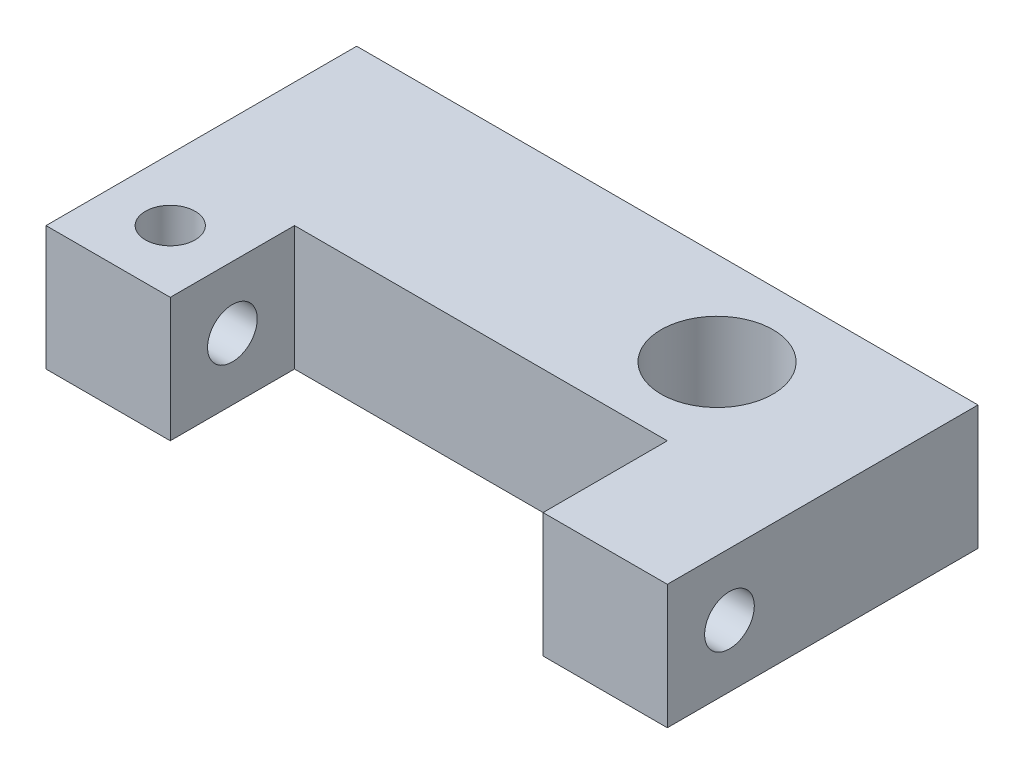
ISO-10303-21;
HEADER;
FILE_DESCRIPTION(('STEP AP214'),'2;1');
FILE_NAME('part.step','',(''),(''),'','','');
FILE_SCHEMA(('AUTOMOTIVE_DESIGN { 1 0 10303 214 1 1 1 1 }'));
ENDSEC;
DATA;
#1=APPLICATION_CONTEXT('core data for automotive mechanical design processes');
#2=APPLICATION_PROTOCOL_DEFINITION('international standard','automotive_design',2000,#1);
#3=PRODUCT_CONTEXT('',#1,'mechanical');
#4=PRODUCT('Part','Part','',(#3));
#5=PRODUCT_RELATED_PRODUCT_CATEGORY('part','',(#4));
#6=PRODUCT_DEFINITION_FORMATION('','',#4);
#7=PRODUCT_DEFINITION_CONTEXT('part definition',#1,'design');
#8=PRODUCT_DEFINITION('design','',#6,#7);
#9=PRODUCT_DEFINITION_SHAPE('','',#8);
#10=(LENGTH_UNIT() NAMED_UNIT(*) SI_UNIT(.MILLI.,.METRE.));
#11=(NAMED_UNIT(*) PLANE_ANGLE_UNIT() SI_UNIT($,.RADIAN.));
#12=(NAMED_UNIT(*) SI_UNIT($,.STERADIAN.) SOLID_ANGLE_UNIT());
#13=UNCERTAINTY_MEASURE_WITH_UNIT(LENGTH_MEASURE(1.E-05),#10,'distance_accuracy_value','');
#14=(GEOMETRIC_REPRESENTATION_CONTEXT(3) GLOBAL_UNCERTAINTY_ASSIGNED_CONTEXT((#13)) GLOBAL_UNIT_ASSIGNED_CONTEXT((#10,
#11,#12)) REPRESENTATION_CONTEXT('',''));
#15=CARTESIAN_POINT('',(0.,0.,0.));
#16=DIRECTION('',(0.,0.,1.));
#17=DIRECTION('',(1.,0.,0.));
#18=AXIS2_PLACEMENT_3D('',#15,#16,#17);
#19=CARTESIAN_POINT('',(0.,0.,0.));
#20=DIRECTION('',(0.,0.,-1.));
#21=DIRECTION('',(-1.,0.,0.));
#22=AXIS2_PLACEMENT_3D('',#19,#20,#21);
#23=PLANE('',#22);
#24=DIRECTION('',(0.,-1.,0.));
#25=VECTOR('',#24,1.);
#26=CARTESIAN_POINT('',(6.00000000000001,4.,0.));
#27=LINE('',#26,#25);
#28=CARTESIAN_POINT('',(6.00000000000001,4.,0.));
#29=VERTEX_POINT('',#28);
#30=CARTESIAN_POINT('',(6.,0.,0.));
#31=VERTEX_POINT('',#30);
#32=EDGE_CURVE('E252',#29,#31,#27,.T.);
#33=ORIENTED_EDGE('',*,*,#32,.F.);
#34=DIRECTION('',(-1.,0.,0.));
#35=VECTOR('',#34,1.);
#36=CARTESIAN_POINT('',(-10.,4.,0.));
#37=LINE('',#36,#35);
#38=CARTESIAN_POINT('',(-6.00000000000001,4.,0.));
#39=VERTEX_POINT('',#38);
#40=EDGE_CURVE('E205',#29,#39,#37,.T.);
#41=ORIENTED_EDGE('',*,*,#40,.T.);
#42=DIRECTION('',(0.,1.,0.));
#43=VECTOR('',#42,1.);
#44=CARTESIAN_POINT('',(-6.00000000000001,4.,0.));
#45=LINE('',#44,#43);
#46=CARTESIAN_POINT('',(-6.00000000000001,0.,0.));
#47=VERTEX_POINT('',#46);
#48=EDGE_CURVE('E247',#47,#39,#45,.T.);
#49=ORIENTED_EDGE('',*,*,#48,.F.);
#50=DIRECTION('',(1.,0.,0.));
#51=VECTOR('',#50,1.);
#52=CARTESIAN_POINT('',(-10.,0.,0.));
#53=LINE('',#52,#51);
#54=CARTESIAN_POINT('',(2.19999999999999,0.,0.));
#55=VERTEX_POINT('',#54);
#56=EDGE_CURVE('E202',#47,#55,#53,.T.);
#57=ORIENTED_EDGE('',*,*,#56,.T.);
#58=DIRECTION('',(0.,-1.,0.));
#59=VECTOR('',#58,1.);
#60=CARTESIAN_POINT('',(2.19999999999999,0.,0.));
#61=LINE('',#60,#59);
#62=CARTESIAN_POINT('',(2.19999999999999,-2.,0.));
#63=VERTEX_POINT('',#62);
#64=EDGE_CURVE('E198',#55,#63,#61,.T.);
#65=ORIENTED_EDGE('',*,*,#64,.T.);
#66=DIRECTION('',(1.,0.,0.));
#67=VECTOR('',#66,1.);
#68=CARTESIAN_POINT('',(2.19999999999999,-2.,0.));
#69=LINE('',#68,#67);
#70=CARTESIAN_POINT('',(6.99999999999999,-2.,0.));
#71=VERTEX_POINT('',#70);
#72=EDGE_CURVE('E194',#63,#71,#69,.T.);
#73=ORIENTED_EDGE('',*,*,#72,.T.);
#74=DIRECTION('',(0.,1.,0.));
#75=VECTOR('',#74,1.);
#76=CARTESIAN_POINT('',(6.99999999999999,0.,0.));
#77=LINE('',#76,#75);
#78=CARTESIAN_POINT('',(6.99999999999999,0.,0.));
#79=VERTEX_POINT('',#78);
#80=EDGE_CURVE('E190',#71,#79,#77,.T.);
#81=ORIENTED_EDGE('',*,*,#80,.T.);
#82=DIRECTION('',(1.,0.,0.));
#83=VECTOR('',#82,1.);
#84=CARTESIAN_POINT('',(10.,0.,0.));
#85=LINE('',#84,#83);
#86=EDGE_CURVE('E64',#31,#79,#85,.T.);
#87=ORIENTED_EDGE('',*,*,#86,.F.);
#88=EDGE_LOOP('',(#33,#41,#49,#57,#65,#73,#81,#87));
#89=FACE_BOUND('',#88,.T.);
#90=ADVANCED_FACE('F43',(#89),#23,.F.);
#91=CARTESIAN_POINT('',(6.99999999999999,0.,-6.));
#92=DIRECTION('',(0.,-1.,0.));
#93=DIRECTION('',(1.,0.,0.));
#94=AXIS2_PLACEMENT_3D('',#91,#92,#93);
#95=PLANE('',#94);
#96=DIRECTION('',(0.,0.,1.));
#97=VECTOR('',#96,1.);
#98=CARTESIAN_POINT('',(9.99999999999999,0.,-6.));
#99=LINE('',#98,#97);
#100=CARTESIAN_POINT('',(9.99999999999999,0.,-6.));
#101=VERTEX_POINT('',#100);
#102=CARTESIAN_POINT('',(10.,0.,4.));
#103=VERTEX_POINT('',#102);
#104=EDGE_CURVE('E165',#101,#103,#99,.T.);
#105=ORIENTED_EDGE('',*,*,#104,.T.);
#106=DIRECTION('',(1.,0.,0.));
#107=VECTOR('',#106,1.);
#108=CARTESIAN_POINT('',(10.,0.,4.));
#109=LINE('',#108,#107);
#110=CARTESIAN_POINT('',(6.,0.,4.));
#111=VERTEX_POINT('',#110);
#112=EDGE_CURVE('E275',#111,#103,#109,.T.);
#113=ORIENTED_EDGE('',*,*,#112,.F.);
#114=DIRECTION('',(0.,0.,-1.));
#115=VECTOR('',#114,1.);
#116=CARTESIAN_POINT('',(6.,0.,4.));
#117=LINE('',#116,#115);
#118=EDGE_CURVE('E279',#111,#31,#117,.T.);
#119=ORIENTED_EDGE('',*,*,#118,.T.);
#120=ORIENTED_EDGE('',*,*,#86,.T.);
#121=DIRECTION('',(0.,0.,1.));
#122=VECTOR('',#121,1.);
#123=CARTESIAN_POINT('',(6.99999999999999,0.,-6.));
#124=LINE('',#123,#122);
#125=CARTESIAN_POINT('',(6.99999999999999,0.,-6.));
#126=VERTEX_POINT('',#125);
#127=EDGE_CURVE('E139',#126,#79,#124,.T.);
#128=ORIENTED_EDGE('',*,*,#127,.F.);
#129=DIRECTION('',(1.,0.,0.));
#130=VECTOR('',#129,1.);
#131=CARTESIAN_POINT('',(6.99999999999999,0.,-6.));
#132=LINE('',#131,#130);
#133=EDGE_CURVE('E193',#126,#101,#132,.T.);
#134=ORIENTED_EDGE('',*,*,#133,.T.);
#135=EDGE_LOOP('',(#105,#113,#119,#120,#128,#134));
#136=FACE_BOUND('',#135,.T.);
#137=ADVANCED_FACE('F45',(#136),#95,.T.);
#138=CARTESIAN_POINT('',(6.99999999999999,0.,-6.));
#139=DIRECTION('',(1.,0.,0.));
#140=DIRECTION('',(0.,0.,-1.));
#141=AXIS2_PLACEMENT_3D('',#138,#139,#140);
#142=PLANE('',#141);
#143=ORIENTED_EDGE('',*,*,#80,.F.);
#144=DIRECTION('',(0.,0.,1.));
#145=VECTOR('',#144,1.);
#146=CARTESIAN_POINT('',(6.99999999999999,-2.,-6.));
#147=LINE('',#146,#145);
#148=CARTESIAN_POINT('',(6.99999999999999,-2.,-6.));
#149=VERTEX_POINT('',#148);
#150=EDGE_CURVE('E185',#149,#71,#147,.T.);
#151=ORIENTED_EDGE('',*,*,#150,.F.);
#152=DIRECTION('',(0.,1.,0.));
#153=VECTOR('',#152,1.);
#154=CARTESIAN_POINT('',(6.99999999999999,0.,-6.));
#155=LINE('',#154,#153);
#156=EDGE_CURVE('E169',#149,#126,#155,.T.);
#157=ORIENTED_EDGE('',*,*,#156,.T.);
#158=ORIENTED_EDGE('',*,*,#127,.T.);
#159=EDGE_LOOP('',(#143,#151,#157,#158));
#160=FACE_BOUND('',#159,.T.);
#161=ADVANCED_FACE('F341',(#160),#142,.T.);
#162=CARTESIAN_POINT('',(2.19999999999999,-2.,-6.));
#163=DIRECTION('',(0.,-1.,0.));
#164=DIRECTION('',(0.,0.,-1.));
#165=AXIS2_PLACEMENT_3D('',#162,#163,#164);
#166=PLANE('',#165);
#167=CARTESIAN_POINT('',(4.59999999999999,-2.,-3.));
#168=DIRECTION('',(0.,1.,0.));
#169=DIRECTION('',(0.,0.,1.));
#170=AXIS2_PLACEMENT_3D('',#167,#168,#169);
#171=CIRCLE('',#170,1.8);
#172=CARTESIAN_POINT('',(4.59999999999999,-2.,-1.2));
#173=VERTEX_POINT('',#172);
#174=EDGE_CURVE('E297',#173,#173,#171,.T.);
#175=ORIENTED_EDGE('',*,*,#174,.T.);
#176=EDGE_LOOP('',(#175));
#177=FACE_BOUND('',#176,.T.);
#178=ORIENTED_EDGE('',*,*,#72,.F.);
#179=DIRECTION('',(0.,0.,1.));
#180=VECTOR('',#179,1.);
#181=CARTESIAN_POINT('',(2.19999999999999,-2.,-6.));
#182=LINE('',#181,#180);
#183=CARTESIAN_POINT('',(2.19999999999999,-2.,-6.));
#184=VERTEX_POINT('',#183);
#185=EDGE_CURVE('E182',#184,#63,#182,.T.);
#186=ORIENTED_EDGE('',*,*,#185,.F.);
#187=DIRECTION('',(1.,0.,0.));
#188=VECTOR('',#187,1.);
#189=CARTESIAN_POINT('',(2.19999999999999,-2.,-6.));
#190=LINE('',#189,#188);
#191=EDGE_CURVE('E212',#184,#149,#190,.T.);
#192=ORIENTED_EDGE('',*,*,#191,.T.);
#193=ORIENTED_EDGE('',*,*,#150,.T.);
#194=EDGE_LOOP('',(#178,#186,#192,#193));
#195=FACE_BOUND('',#194,.T.);
#196=ADVANCED_FACE('F344',(#177,#195),#166,.T.);
#197=CARTESIAN_POINT('',(2.19999999999999,0.,-6.));
#198=DIRECTION('',(-1.,0.,0.));
#199=DIRECTION('',(0.,-1.,0.));
#200=AXIS2_PLACEMENT_3D('',#197,#198,#199);
#201=PLANE('',#200);
#202=ORIENTED_EDGE('',*,*,#64,.F.);
#203=DIRECTION('',(0.,0.,1.));
#204=VECTOR('',#203,1.);
#205=CARTESIAN_POINT('',(2.19999999999999,0.,-6.));
#206=LINE('',#205,#204);
#207=CARTESIAN_POINT('',(2.19999999999999,0.,-6.));
#208=VERTEX_POINT('',#207);
#209=EDGE_CURVE('E178',#208,#55,#206,.T.);
#210=ORIENTED_EDGE('',*,*,#209,.F.);
#211=DIRECTION('',(0.,-1.,0.));
#212=VECTOR('',#211,1.);
#213=CARTESIAN_POINT('',(2.19999999999999,0.,-6.));
#214=LINE('',#213,#212);
#215=EDGE_CURVE('E216',#208,#184,#214,.T.);
#216=ORIENTED_EDGE('',*,*,#215,.T.);
#217=ORIENTED_EDGE('',*,*,#185,.T.);
#218=EDGE_LOOP('',(#202,#210,#216,#217));
#219=FACE_BOUND('',#218,.T.);
#220=ADVANCED_FACE('F348',(#219),#201,.T.);
#221=CARTESIAN_POINT('',(-10.,0.,-6.));
#222=DIRECTION('',(0.,-1.,0.));
#223=DIRECTION('',(1.,0.,0.));
#224=AXIS2_PLACEMENT_3D('',#221,#222,#223);
#225=PLANE('',#224);
#226=ORIENTED_EDGE('',*,*,#56,.F.);
#227=DIRECTION('',(0.,0.,-1.));
#228=VECTOR('',#227,1.);
#229=CARTESIAN_POINT('',(-6.,0.,4.));
#230=LINE('',#229,#228);
#231=CARTESIAN_POINT('',(-6.,0.,4.));
#232=VERTEX_POINT('',#231);
#233=EDGE_CURVE('E208',#232,#47,#230,.T.);
#234=ORIENTED_EDGE('',*,*,#233,.F.);
#235=DIRECTION('',(1.,0.,0.));
#236=VECTOR('',#235,1.);
#237=CARTESIAN_POINT('',(-10.,0.,4.));
#238=LINE('',#237,#236);
#239=CARTESIAN_POINT('',(-10.,0.,4.));
#240=VERTEX_POINT('',#239);
#241=EDGE_CURVE('E259',#240,#232,#238,.T.);
#242=ORIENTED_EDGE('',*,*,#241,.F.);
#243=DIRECTION('',(0.,0.,1.));
#244=VECTOR('',#243,1.);
#245=CARTESIAN_POINT('',(-10.,0.,-6.));
#246=LINE('',#245,#244);
#247=CARTESIAN_POINT('',(-10.,0.,-6.));
#248=VERTEX_POINT('',#247);
#249=EDGE_CURVE('E175',#248,#240,#246,.T.);
#250=ORIENTED_EDGE('',*,*,#249,.F.);
#251=DIRECTION('',(1.,0.,0.));
#252=VECTOR('',#251,1.);
#253=CARTESIAN_POINT('',(-10.,0.,-6.));
#254=LINE('',#253,#252);
#255=EDGE_CURVE('E220',#248,#208,#254,.T.);
#256=ORIENTED_EDGE('',*,*,#255,.T.);
#257=ORIENTED_EDGE('',*,*,#209,.T.);
#258=EDGE_LOOP('',(#226,#234,#242,#250,#256,#257));
#259=FACE_BOUND('',#258,.T.);
#260=ADVANCED_FACE('F351',(#259),#225,.T.);
#261=CARTESIAN_POINT('',(-10.,4.,-6.));
#262=DIRECTION('',(-1.,0.,0.));
#263=DIRECTION('',(0.,0.,1.));
#264=AXIS2_PLACEMENT_3D('',#261,#262,#263);
#265=PLANE('',#264);
#266=CARTESIAN_POINT('',(-10.,2.,2.));
#267=DIRECTION('',(1.,0.,0.));
#268=DIRECTION('',(0.,0.,-1.));
#269=AXIS2_PLACEMENT_3D('',#266,#267,#268);
#270=CIRCLE('',#269,0.799999999999997);
#271=CARTESIAN_POINT('',(-10.,2.,1.2));
#272=VERTEX_POINT('',#271);
#273=EDGE_CURVE('E149',#272,#272,#270,.T.);
#274=ORIENTED_EDGE('',*,*,#273,.T.);
#275=EDGE_LOOP('',(#274));
#276=FACE_BOUND('',#275,.T.);
#277=ORIENTED_EDGE('',*,*,#249,.T.);
#278=DIRECTION('',(0.,-1.,0.));
#279=VECTOR('',#278,1.);
#280=CARTESIAN_POINT('',(-10.,4.,4.));
#281=LINE('',#280,#279);
#282=CARTESIAN_POINT('',(-10.,4.,4.));
#283=VERTEX_POINT('',#282);
#284=EDGE_CURVE('E251',#283,#240,#281,.T.);
#285=ORIENTED_EDGE('',*,*,#284,.F.);
#286=DIRECTION('',(0.,0.,1.));
#287=VECTOR('',#286,1.);
#288=CARTESIAN_POINT('',(-10.,4.,-6.));
#289=LINE('',#288,#287);
#290=CARTESIAN_POINT('',(-10.,4.,-6.));
#291=VERTEX_POINT('',#290);
#292=EDGE_CURVE('E172',#291,#283,#289,.T.);
#293=ORIENTED_EDGE('',*,*,#292,.F.);
#294=DIRECTION('',(0.,-1.,0.));
#295=VECTOR('',#294,1.);
#296=CARTESIAN_POINT('',(-10.,4.,-6.));
#297=LINE('',#296,#295);
#298=EDGE_CURVE('E224',#291,#248,#297,.T.);
#299=ORIENTED_EDGE('',*,*,#298,.T.);
#300=EDGE_LOOP('',(#277,#285,#293,#299));
#301=FACE_BOUND('',#300,.T.);
#302=ADVANCED_FACE('F312',(#276,#301),#265,.T.);
#303=CARTESIAN_POINT('',(-10.,4.,-6.));
#304=DIRECTION('',(0.,1.,0.));
#305=DIRECTION('',(-1.,0.,0.));
#306=AXIS2_PLACEMENT_3D('',#303,#304,#305);
#307=PLANE('',#306);
#308=CARTESIAN_POINT('',(4.59999999999999,4.,-3.));
#309=DIRECTION('',(0.,1.,0.));
#310=DIRECTION('',(0.,0.,1.));
#311=AXIS2_PLACEMENT_3D('',#308,#309,#310);
#312=CIRCLE('',#311,1.8);
#313=CARTESIAN_POINT('',(4.59999999999999,4.,-1.2));
#314=VERTEX_POINT('',#313);
#315=EDGE_CURVE('E301',#314,#314,#312,.T.);
#316=ORIENTED_EDGE('',*,*,#315,.F.);
#317=EDGE_LOOP('',(#316));
#318=FACE_BOUND('',#317,.T.);
#319=CARTESIAN_POINT('',(-8.00000000000001,4.,2.));
#320=DIRECTION('',(0.,1.,0.));
#321=DIRECTION('',(0.,0.,1.));
#322=AXIS2_PLACEMENT_3D('',#319,#320,#321);
#323=CIRCLE('',#322,0.799999999999988);
#324=CARTESIAN_POINT('',(-8.00000000000001,4.,2.79999999999999));
#325=VERTEX_POINT('',#324);
#326=EDGE_CURVE('E293',#325,#325,#323,.T.);
#327=ORIENTED_EDGE('',*,*,#326,.F.);
#328=EDGE_LOOP('',(#327));
#329=FACE_BOUND('',#328,.T.);
#330=ORIENTED_EDGE('',*,*,#40,.F.);
#331=DIRECTION('',(0.,0.,-1.));
#332=VECTOR('',#331,1.);
#333=CARTESIAN_POINT('',(6.00000000000001,4.,4.));
#334=LINE('',#333,#332);
#335=CARTESIAN_POINT('',(6.00000000000001,4.,4.));
#336=VERTEX_POINT('',#335);
#337=EDGE_CURVE('E160',#336,#29,#334,.T.);
#338=ORIENTED_EDGE('',*,*,#337,.F.);
#339=DIRECTION('',(-1.,0.,0.));
#340=VECTOR('',#339,1.);
#341=CARTESIAN_POINT('',(10.,4.,4.));
#342=LINE('',#341,#340);
#343=CARTESIAN_POINT('',(10.,4.,4.));
#344=VERTEX_POINT('',#343);
#345=EDGE_CURVE('E269',#344,#336,#342,.T.);
#346=ORIENTED_EDGE('',*,*,#345,.F.);
#347=DIRECTION('',(0.,0.,1.));
#348=VECTOR('',#347,1.);
#349=CARTESIAN_POINT('',(9.99999999999999,4.,-6.));
#350=LINE('',#349,#348);
#351=CARTESIAN_POINT('',(9.99999999999999,4.,-6.));
#352=VERTEX_POINT('',#351);
#353=EDGE_CURVE('E168',#352,#344,#350,.T.);
#354=ORIENTED_EDGE('',*,*,#353,.F.);
#355=DIRECTION('',(-1.,0.,0.));
#356=VECTOR('',#355,1.);
#357=CARTESIAN_POINT('',(-10.,4.,-6.));
#358=LINE('',#357,#356);
#359=EDGE_CURVE('E228',#352,#291,#358,.T.);
#360=ORIENTED_EDGE('',*,*,#359,.T.);
#361=ORIENTED_EDGE('',*,*,#292,.T.);
#362=DIRECTION('',(-1.,0.,0.));
#363=VECTOR('',#362,1.);
#364=CARTESIAN_POINT('',(-10.,4.,4.));
#365=LINE('',#364,#363);
#366=CARTESIAN_POINT('',(-6.00000000000001,4.,4.));
#367=VERTEX_POINT('',#366);
#368=EDGE_CURVE('E246',#367,#283,#365,.T.);
#369=ORIENTED_EDGE('',*,*,#368,.F.);
#370=DIRECTION('',(0.,0.,-1.));
#371=VECTOR('',#370,1.);
#372=CARTESIAN_POINT('',(-6.00000000000001,4.,4.));
#373=LINE('',#372,#371);
#374=EDGE_CURVE('E242',#367,#39,#373,.T.);
#375=ORIENTED_EDGE('',*,*,#374,.T.);
#376=EDGE_LOOP('',(#330,#338,#346,#354,#360,#361,#369,#375));
#377=FACE_BOUND('',#376,.T.);
#378=ADVANCED_FACE('F308',(#318,#329,#377),#307,.T.);
#379=CARTESIAN_POINT('',(9.99999999999999,4.,-6.));
#380=DIRECTION('',(1.,0.,0.));
#381=DIRECTION('',(0.,0.,-1.));
#382=AXIS2_PLACEMENT_3D('',#379,#380,#381);
#383=PLANE('',#382);
#384=CARTESIAN_POINT('',(9.99999999999999,2.,2.));
#385=DIRECTION('',(1.,0.,0.));
#386=DIRECTION('',(0.,0.,-1.));
#387=AXIS2_PLACEMENT_3D('',#384,#385,#386);
#388=CIRCLE('',#387,0.8);
#389=CARTESIAN_POINT('',(9.99999999999999,2.,1.2));
#390=VERTEX_POINT('',#389);
#391=EDGE_CURVE('E162',#390,#390,#388,.T.);
#392=ORIENTED_EDGE('',*,*,#391,.F.);
#393=EDGE_LOOP('',(#392));
#394=FACE_BOUND('',#393,.T.);
#395=ORIENTED_EDGE('',*,*,#353,.T.);
#396=DIRECTION('',(0.,1.,0.));
#397=VECTOR('',#396,1.);
#398=CARTESIAN_POINT('',(10.,4.,4.));
#399=LINE('',#398,#397);
#400=EDGE_CURVE('E265',#103,#344,#399,.T.);
#401=ORIENTED_EDGE('',*,*,#400,.F.);
#402=ORIENTED_EDGE('',*,*,#104,.F.);
#403=DIRECTION('',(0.,1.,0.));
#404=VECTOR('',#403,1.);
#405=CARTESIAN_POINT('',(9.99999999999999,4.,-6.));
#406=LINE('',#405,#404);
#407=EDGE_CURVE('E232',#101,#352,#406,.T.);
#408=ORIENTED_EDGE('',*,*,#407,.T.);
#409=EDGE_LOOP('',(#395,#401,#402,#408));
#410=FACE_BOUND('',#409,.T.);
#411=ADVANCED_FACE('F311',(#394,#410),#383,.T.);
#412=CARTESIAN_POINT('',(0.,0.,-6.));
#413=DIRECTION('',(0.,0.,-1.));
#414=DIRECTION('',(-1.,0.,0.));
#415=AXIS2_PLACEMENT_3D('',#412,#413,#414);
#416=PLANE('',#415);
#417=ORIENTED_EDGE('',*,*,#133,.F.);
#418=ORIENTED_EDGE('',*,*,#156,.F.);
#419=ORIENTED_EDGE('',*,*,#191,.F.);
#420=ORIENTED_EDGE('',*,*,#215,.F.);
#421=ORIENTED_EDGE('',*,*,#255,.F.);
#422=ORIENTED_EDGE('',*,*,#298,.F.);
#423=ORIENTED_EDGE('',*,*,#359,.F.);
#424=ORIENTED_EDGE('',*,*,#407,.F.);
#425=EDGE_LOOP('',(#417,#418,#419,#420,#421,#422,#423,#424));
#426=FACE_BOUND('',#425,.T.);
#427=ADVANCED_FACE('F334',(#426),#416,.T.);
#428=CARTESIAN_POINT('',(-6.00000000000001,4.,4.));
#429=DIRECTION('',(-1.,0.,0.));
#430=DIRECTION('',(0.,-1.,0.));
#431=AXIS2_PLACEMENT_3D('',#428,#429,#430);
#432=PLANE('',#431);
#433=CARTESIAN_POINT('',(-6.00000000000001,2.,2.));
#434=DIRECTION('',(-1.,0.,0.));
#435=DIRECTION('',(0.,-1.,0.));
#436=AXIS2_PLACEMENT_3D('',#433,#434,#435);
#437=CIRCLE('',#436,0.799999999999999);
#438=CARTESIAN_POINT('',(-6.00000000000001,1.2,2.));
#439=VERTEX_POINT('',#438);
#440=EDGE_CURVE('E152',#439,#439,#437,.T.);
#441=ORIENTED_EDGE('',*,*,#440,.T.);
#442=EDGE_LOOP('',(#441));
#443=FACE_BOUND('',#442,.T.);
#444=ORIENTED_EDGE('',*,*,#48,.T.);
#445=ORIENTED_EDGE('',*,*,#374,.F.);
#446=DIRECTION('',(0.,1.,0.));
#447=VECTOR('',#446,1.);
#448=CARTESIAN_POINT('',(-6.00000000000001,4.,4.));
#449=LINE('',#448,#447);
#450=EDGE_CURVE('E256',#232,#367,#449,.T.);
#451=ORIENTED_EDGE('',*,*,#450,.F.);
#452=ORIENTED_EDGE('',*,*,#233,.T.);
#453=EDGE_LOOP('',(#444,#445,#451,#452));
#454=FACE_BOUND('',#453,.T.);
#455=ADVANCED_FACE('F360',(#443,#454),#432,.F.);
#456=CARTESIAN_POINT('',(0.,0.,4.));
#457=DIRECTION('',(0.,0.,1.));
#458=DIRECTION('',(1.,0.,0.));
#459=AXIS2_PLACEMENT_3D('',#456,#457,#458);
#460=PLANE('',#459);
#461=ORIENTED_EDGE('',*,*,#284,.T.);
#462=ORIENTED_EDGE('',*,*,#241,.T.);
#463=ORIENTED_EDGE('',*,*,#450,.T.);
#464=ORIENTED_EDGE('',*,*,#368,.T.);
#465=EDGE_LOOP('',(#461,#462,#463,#464));
#466=FACE_BOUND('',#465,.T.);
#467=ADVANCED_FACE('F357',(#466),#460,.T.);
#468=CARTESIAN_POINT('',(6.00000000000001,4.,4.));
#469=DIRECTION('',(1.,0.,0.));
#470=DIRECTION('',(0.,1.,0.));
#471=AXIS2_PLACEMENT_3D('',#468,#469,#470);
#472=PLANE('',#471);
#473=CARTESIAN_POINT('',(6.,2.,2.));
#474=DIRECTION('',(1.,0.,0.));
#475=DIRECTION('',(0.,1.,0.));
#476=AXIS2_PLACEMENT_3D('',#473,#474,#475);
#477=CIRCLE('',#476,0.799999999999999);
#478=CARTESIAN_POINT('',(6.,2.8,2.));
#479=VERTEX_POINT('',#478);
#480=EDGE_CURVE('E155',#479,#479,#477,.T.);
#481=ORIENTED_EDGE('',*,*,#480,.T.);
#482=EDGE_LOOP('',(#481));
#483=FACE_BOUND('',#482,.T.);
#484=ORIENTED_EDGE('',*,*,#32,.T.);
#485=ORIENTED_EDGE('',*,*,#118,.F.);
#486=DIRECTION('',(0.,-1.,0.));
#487=VECTOR('',#486,1.);
#488=CARTESIAN_POINT('',(6.00000000000001,4.,4.));
#489=LINE('',#488,#487);
#490=EDGE_CURVE('E272',#336,#111,#489,.T.);
#491=ORIENTED_EDGE('',*,*,#490,.F.);
#492=ORIENTED_EDGE('',*,*,#337,.T.);
#493=EDGE_LOOP('',(#484,#485,#491,#492));
#494=FACE_BOUND('',#493,.T.);
#495=ADVANCED_FACE('F323',(#483,#494),#472,.F.);
#496=CARTESIAN_POINT('',(0.,0.,4.));
#497=DIRECTION('',(0.,0.,-1.));
#498=DIRECTION('',(-1.,0.,0.));
#499=AXIS2_PLACEMENT_3D('',#496,#497,#498);
#500=PLANE('',#499);
#501=ORIENTED_EDGE('',*,*,#400,.T.);
#502=ORIENTED_EDGE('',*,*,#345,.T.);
#503=ORIENTED_EDGE('',*,*,#490,.T.);
#504=ORIENTED_EDGE('',*,*,#112,.T.);
#505=EDGE_LOOP('',(#501,#502,#503,#504));
#506=FACE_BOUND('',#505,.T.);
#507=ADVANCED_FACE('F144',(#506),#500,.F.);
#508=CARTESIAN_POINT('',(9.99999999999999,2.,2.));
#509=DIRECTION('',(1.,0.,0.));
#510=DIRECTION('',(0.,0.,-1.));
#511=AXIS2_PLACEMENT_3D('',#508,#509,#510);
#512=CYLINDRICAL_SURFACE('',#511,0.799999999999999);
#513=CARTESIAN_POINT('',(-8.00000000000001,2.,2.));
#514=DIRECTION('',(0.707106781186547,-0.707106781186547,0.));
#515=DIRECTION('',(0.707106781186547,0.707106781186547,0.));
#516=AXIS2_PLACEMENT_3D('',#513,#514,#515);
#517=ELLIPSE('',#516,1.13137084989847,0.799999999999996);
#518=CARTESIAN_POINT('',(-8.00000000000001,2.,2.8));
#519=VERTEX_POINT('',#518);
#520=CARTESIAN_POINT('',(-8.00000000000001,2.,1.2));
#521=VERTEX_POINT('',#520);
#522=EDGE_CURVE('E52',#519,#521,#517,.F.);
#523=ORIENTED_EDGE('',*,*,#522,.T.);
#524=CARTESIAN_POINT('',(-8.00000000000001,2.,2.));
#525=DIRECTION('',(0.707106781186547,0.707106781186547,0.));
#526=DIRECTION('',(0.707106781186547,-0.707106781186547,0.));
#527=AXIS2_PLACEMENT_3D('',#524,#525,#526);
#528=ELLIPSE('',#527,1.13137084989847,0.799999999999996);
#529=EDGE_CURVE('E11',#521,#519,#528,.T.);
#530=ORIENTED_EDGE('',*,*,#529,.T.);
#531=EDGE_LOOP('',(#523,#530));
#532=FACE_BOUND('',#531,.T.);
#533=ORIENTED_EDGE('',*,*,#273,.F.);
#534=EDGE_LOOP('',(#533));
#535=FACE_BOUND('',#534,.T.);
#536=ORIENTED_EDGE('',*,*,#440,.F.);
#537=EDGE_LOOP('',(#536));
#538=FACE_BOUND('',#537,.T.);
#539=ADVANCED_FACE('F140',(#532,#535,#538),#512,.F.);
#540=ORIENTED_EDGE('',*,*,#391,.T.);
#541=EDGE_LOOP('',(#540));
#542=FACE_BOUND('',#541,.T.);
#543=ORIENTED_EDGE('',*,*,#480,.F.);
#544=EDGE_LOOP('',(#543));
#545=FACE_BOUND('',#544,.T.);
#546=ADVANCED_FACE('F143',(#542,#545),#512,.F.);
#547=CARTESIAN_POINT('',(-8.00000000000001,4.,2.));
#548=DIRECTION('',(0.,1.,0.));
#549=DIRECTION('',(0.,0.,1.));
#550=AXIS2_PLACEMENT_3D('',#547,#548,#549);
#551=CYLINDRICAL_SURFACE('',#550,0.799999999999994);
#552=ORIENTED_EDGE('',*,*,#522,.F.);
#553=ORIENTED_EDGE('',*,*,#529,.F.);
#554=EDGE_LOOP('',(#552,#553));
#555=FACE_BOUND('',#554,.T.);
#556=ORIENTED_EDGE('',*,*,#326,.T.);
#557=EDGE_LOOP('',(#556));
#558=FACE_BOUND('',#557,.T.);
#559=ADVANCED_FACE('F135',(#555,#558),#551,.F.);
#560=CARTESIAN_POINT('',(4.59999999999999,4.,-3.));
#561=DIRECTION('',(0.,1.,0.));
#562=DIRECTION('',(0.,0.,1.));
#563=AXIS2_PLACEMENT_3D('',#560,#561,#562);
#564=CYLINDRICAL_SURFACE('',#563,1.8);
#565=ORIENTED_EDGE('',*,*,#174,.F.);
#566=EDGE_LOOP('',(#565));
#567=FACE_BOUND('',#566,.T.);
#568=ORIENTED_EDGE('',*,*,#315,.T.);
#569=EDGE_LOOP('',(#568));
#570=FACE_BOUND('',#569,.T.);
#571=ADVANCED_FACE('F306',(#567,#570),#564,.F.);
#572=CLOSED_SHELL('',(#90,#137,#161,#196,#220,#260,#302,#378,#411,#427,#455,#467,#495,#507,#539,
#546,#559,#571));
#573=MANIFOLD_SOLID_BREP('B2',#572);
#574=ADVANCED_BREP_SHAPE_REPRESENTATION('',(#18,#573),#14);
#575=SHAPE_DEFINITION_REPRESENTATION(#9,#574);
ENDSEC;
END-ISO-10303-21;
